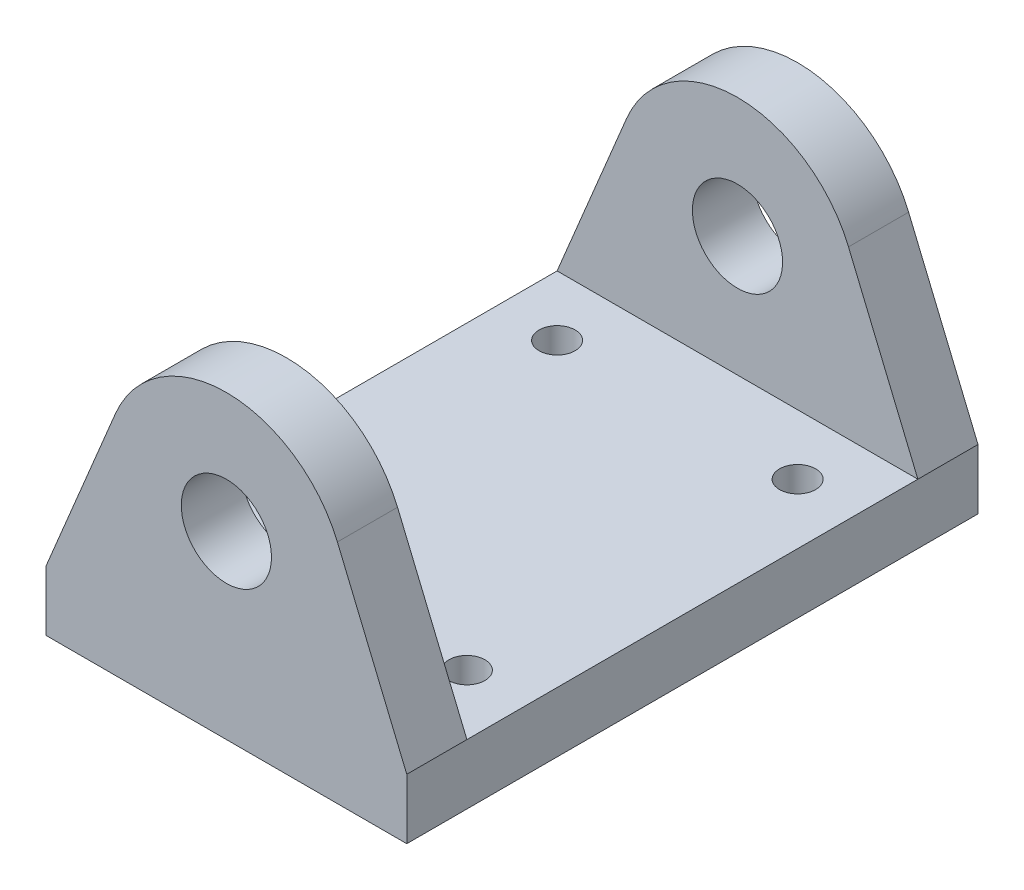
ISO-10303-21;
HEADER;
FILE_DESCRIPTION(('STEP AP214'),'2;1');
FILE_NAME('part.step','',(''),(''),'','','');
FILE_SCHEMA(('AUTOMOTIVE_DESIGN { 1 0 10303 214 1 1 1 1 }'));
ENDSEC;
DATA;
#1=APPLICATION_CONTEXT('core data for automotive mechanical design processes');
#2=APPLICATION_PROTOCOL_DEFINITION('international standard','automotive_design',2000,#1);
#3=PRODUCT_CONTEXT('',#1,'mechanical');
#4=PRODUCT('Part','Part','',(#3));
#5=PRODUCT_RELATED_PRODUCT_CATEGORY('part','',(#4));
#6=PRODUCT_DEFINITION_FORMATION('','',#4);
#7=PRODUCT_DEFINITION_CONTEXT('part definition',#1,'design');
#8=PRODUCT_DEFINITION('design','',#6,#7);
#9=PRODUCT_DEFINITION_SHAPE('','',#8);
#10=(LENGTH_UNIT() NAMED_UNIT(*) SI_UNIT(.MILLI.,.METRE.));
#11=(NAMED_UNIT(*) PLANE_ANGLE_UNIT() SI_UNIT($,.RADIAN.));
#12=(NAMED_UNIT(*) SI_UNIT($,.STERADIAN.) SOLID_ANGLE_UNIT());
#13=UNCERTAINTY_MEASURE_WITH_UNIT(LENGTH_MEASURE(1.E-05),#10,'distance_accuracy_value','');
#14=(GEOMETRIC_REPRESENTATION_CONTEXT(3) GLOBAL_UNCERTAINTY_ASSIGNED_CONTEXT((#13)) GLOBAL_UNIT_ASSIGNED_CONTEXT((#10,
#11,#12)) REPRESENTATION_CONTEXT('',''));
#15=CARTESIAN_POINT('',(0.,0.,0.));
#16=DIRECTION('',(0.,0.,1.));
#17=DIRECTION('',(1.,0.,0.));
#18=AXIS2_PLACEMENT_3D('',#15,#16,#17);
#19=CARTESIAN_POINT('',(-15.,-10.,23.75));
#20=DIRECTION('',(0.923076923076923,-0.384615384615384,0.));
#21=DIRECTION('',(0.384615384615384,0.923076923076923,0.));
#22=AXIS2_PLACEMENT_3D('',#19,#20,#21);
#23=PLANE('',#22);
#24=DIRECTION('',(0.,0.,-1.));
#25=VECTOR('',#24,1.);
#26=CARTESIAN_POINT('',(-9.23076923076924,3.84615384615385,23.75));
#27=LINE('',#26,#25);
#28=CARTESIAN_POINT('',(-9.23076923076924,3.84615384615385,23.75));
#29=VERTEX_POINT('',#28);
#30=CARTESIAN_POINT('',(-9.23076923076924,3.84615384615385,18.75));
#31=VERTEX_POINT('',#30);
#32=EDGE_CURVE('E149',#29,#31,#27,.T.);
#33=ORIENTED_EDGE('',*,*,#32,.T.);
#34=DIRECTION('',(-0.384615384615384,-0.923076923076923,0.));
#35=VECTOR('',#34,1.);
#36=CARTESIAN_POINT('',(-15.,-10.,18.75));
#37=LINE('',#36,#35);
#38=CARTESIAN_POINT('',(-15.,-10.,18.75));
#39=VERTEX_POINT('',#38);
#40=EDGE_CURVE('E129',#31,#39,#37,.T.);
#41=ORIENTED_EDGE('',*,*,#40,.T.);
#42=DIRECTION('',(0.,0.,-1.));
#43=VECTOR('',#42,1.);
#44=CARTESIAN_POINT('',(-15.,-10.,23.75));
#45=LINE('',#44,#43);
#46=CARTESIAN_POINT('',(-15.,-10.,23.75));
#47=VERTEX_POINT('',#46);
#48=EDGE_CURVE('E11',#47,#39,#45,.T.);
#49=ORIENTED_EDGE('',*,*,#48,.F.);
#50=DIRECTION('',(-0.384615384615384,-0.923076923076923,0.));
#51=VECTOR('',#50,1.);
#52=CARTESIAN_POINT('',(-15.,-10.,23.75));
#53=LINE('',#52,#51);
#54=EDGE_CURVE('E89',#29,#47,#53,.T.);
#55=ORIENTED_EDGE('',*,*,#54,.F.);
#56=EDGE_LOOP('',(#33,#41,#49,#55));
#57=FACE_BOUND('',#56,.T.);
#58=ADVANCED_FACE('F38',(#57),#23,.F.);
#59=CARTESIAN_POINT('',(15.,-10.,23.75));
#60=DIRECTION('',(-0.923076923076923,-0.384615384615384,0.));
#61=DIRECTION('',(0.384615384615384,-0.923076923076923,0.));
#62=AXIS2_PLACEMENT_3D('',#59,#60,#61);
#63=PLANE('',#62);
#64=DIRECTION('',(0.,0.,-1.));
#65=VECTOR('',#64,1.);
#66=CARTESIAN_POINT('',(15.,-10.,23.75));
#67=LINE('',#66,#65);
#68=CARTESIAN_POINT('',(15.,-10.,23.75));
#69=VERTEX_POINT('',#68);
#70=CARTESIAN_POINT('',(15.,-10.,18.75));
#71=VERTEX_POINT('',#70);
#72=EDGE_CURVE('E213',#69,#71,#67,.T.);
#73=ORIENTED_EDGE('',*,*,#72,.T.);
#74=DIRECTION('',(-0.384615384615384,0.923076923076923,0.));
#75=VECTOR('',#74,1.);
#76=CARTESIAN_POINT('',(15.,-10.,18.75));
#77=LINE('',#76,#75);
#78=CARTESIAN_POINT('',(9.23076923076923,3.84615384615385,18.75));
#79=VERTEX_POINT('',#78);
#80=EDGE_CURVE('E132',#71,#79,#77,.T.);
#81=ORIENTED_EDGE('',*,*,#80,.T.);
#82=DIRECTION('',(0.,0.,-1.));
#83=VECTOR('',#82,1.);
#84=CARTESIAN_POINT('',(9.23076923076923,3.84615384615385,23.75));
#85=LINE('',#84,#83);
#86=CARTESIAN_POINT('',(9.23076923076923,3.84615384615385,23.75));
#87=VERTEX_POINT('',#86);
#88=EDGE_CURVE('E208',#87,#79,#85,.T.);
#89=ORIENTED_EDGE('',*,*,#88,.F.);
#90=DIRECTION('',(-0.384615384615384,0.923076923076923,0.));
#91=VECTOR('',#90,1.);
#92=CARTESIAN_POINT('',(15.,-10.,23.75));
#93=LINE('',#92,#91);
#94=EDGE_CURVE('E191',#69,#87,#93,.T.);
#95=ORIENTED_EDGE('',*,*,#94,.F.);
#96=EDGE_LOOP('',(#73,#81,#89,#95));
#97=FACE_BOUND('',#96,.T.);
#98=ADVANCED_FACE('F274',(#97),#63,.F.);
#99=CARTESIAN_POINT('',(0.,0.,23.75));
#100=DIRECTION('',(0.,0.,-1.));
#101=DIRECTION('',(-1.,0.,0.));
#102=AXIS2_PLACEMENT_3D('',#99,#100,#101);
#103=CYLINDRICAL_SURFACE('',#102,10.);
#104=ORIENTED_EDGE('',*,*,#88,.T.);
#105=CARTESIAN_POINT('',(0.,0.,18.75));
#106=DIRECTION('',(0.,0.,1.));
#107=DIRECTION('',(0.,-1.,0.));
#108=AXIS2_PLACEMENT_3D('',#105,#106,#107);
#109=CIRCLE('',#108,10.);
#110=EDGE_CURVE('E239',#79,#31,#109,.T.);
#111=ORIENTED_EDGE('',*,*,#110,.T.);
#112=ORIENTED_EDGE('',*,*,#32,.F.);
#113=CARTESIAN_POINT('',(0.,0.,23.75));
#114=DIRECTION('',(0.,0.,1.));
#115=DIRECTION('',(1.,0.,0.));
#116=AXIS2_PLACEMENT_3D('',#113,#114,#115);
#117=CIRCLE('',#116,10.);
#118=EDGE_CURVE('E65',#87,#29,#117,.T.);
#119=ORIENTED_EDGE('',*,*,#118,.F.);
#120=EDGE_LOOP('',(#104,#111,#112,#119));
#121=FACE_BOUND('',#120,.T.);
#122=ADVANCED_FACE('F267',(#121),#103,.T.);
#123=CARTESIAN_POINT('',(0.,0.,23.75));
#124=DIRECTION('',(0.,0.,-1.));
#125=DIRECTION('',(-1.,0.,0.));
#126=AXIS2_PLACEMENT_3D('',#123,#124,#125);
#127=CYLINDRICAL_SURFACE('',#126,3.75);
#128=CARTESIAN_POINT('',(0.,0.,18.75));
#129=DIRECTION('',(0.,0.,1.));
#130=DIRECTION('',(0.,-1.,0.));
#131=AXIS2_PLACEMENT_3D('',#128,#129,#130);
#132=CIRCLE('',#131,3.75);
#133=CARTESIAN_POINT('',(0.,-3.75,18.75));
#134=VERTEX_POINT('',#133);
#135=EDGE_CURVE('E42',#134,#134,#132,.T.);
#136=ORIENTED_EDGE('',*,*,#135,.F.);
#137=EDGE_LOOP('',(#136));
#138=FACE_BOUND('',#137,.T.);
#139=CARTESIAN_POINT('',(0.,0.,23.75));
#140=DIRECTION('',(0.,0.,1.));
#141=DIRECTION('',(1.,0.,0.));
#142=AXIS2_PLACEMENT_3D('',#139,#140,#141);
#143=CIRCLE('',#142,3.75);
#144=CARTESIAN_POINT('',(3.75,0.,23.75));
#145=VERTEX_POINT('',#144);
#146=EDGE_CURVE('E181',#145,#145,#143,.T.);
#147=ORIENTED_EDGE('',*,*,#146,.T.);
#148=EDGE_LOOP('',(#147));
#149=FACE_BOUND('',#148,.T.);
#150=ADVANCED_FACE('F262',(#138,#149),#127,.F.);
#151=CARTESIAN_POINT('',(0.,0.,23.75));
#152=DIRECTION('',(0.,0.,1.));
#153=DIRECTION('',(1.,0.,0.));
#154=AXIS2_PLACEMENT_3D('',#151,#152,#153);
#155=PLANE('',#154);
#156=ORIENTED_EDGE('',*,*,#54,.T.);
#157=DIRECTION('',(0.,1.,0.));
#158=VECTOR('',#157,1.);
#159=CARTESIAN_POINT('',(-15.,-15.,23.75));
#160=LINE('',#159,#158);
#161=CARTESIAN_POINT('',(-15.,-15.,23.75));
#162=VERTEX_POINT('',#161);
#163=EDGE_CURVE('E155',#162,#47,#160,.T.);
#164=ORIENTED_EDGE('',*,*,#163,.F.);
#165=DIRECTION('',(-1.,0.,0.));
#166=VECTOR('',#165,1.);
#167=CARTESIAN_POINT('',(15.,-15.,23.75));
#168=LINE('',#167,#166);
#169=CARTESIAN_POINT('',(15.,-15.,23.75));
#170=VERTEX_POINT('',#169);
#171=EDGE_CURVE('E161',#170,#162,#168,.T.);
#172=ORIENTED_EDGE('',*,*,#171,.F.);
#173=DIRECTION('',(0.,1.,0.));
#174=VECTOR('',#173,1.);
#175=CARTESIAN_POINT('',(15.,-15.,23.75));
#176=LINE('',#175,#174);
#177=EDGE_CURVE('E160',#170,#69,#176,.T.);
#178=ORIENTED_EDGE('',*,*,#177,.T.);
#179=ORIENTED_EDGE('',*,*,#94,.T.);
#180=ORIENTED_EDGE('',*,*,#118,.T.);
#181=EDGE_LOOP('',(#156,#164,#172,#178,#179,#180));
#182=FACE_BOUND('',#181,.T.);
#183=ORIENTED_EDGE('',*,*,#146,.F.);
#184=EDGE_LOOP('',(#183));
#185=FACE_BOUND('',#184,.T.);
#186=ADVANCED_FACE('F258',(#182,#185),#155,.T.);
#187=CARTESIAN_POINT('',(0.,0.,-23.75));
#188=DIRECTION('',(0.,0.,1.));
#189=DIRECTION('',(1.,0.,0.));
#190=AXIS2_PLACEMENT_3D('',#187,#188,#189);
#191=PLANE('',#190);
#192=DIRECTION('',(-0.384615384615384,-0.923076923076923,0.));
#193=VECTOR('',#192,1.);
#194=CARTESIAN_POINT('',(-15.,-10.,-23.75));
#195=LINE('',#194,#193);
#196=CARTESIAN_POINT('',(-9.23076923076924,3.84615384615385,-23.75));
#197=VERTEX_POINT('',#196);
#198=CARTESIAN_POINT('',(-15.,-10.,-23.75));
#199=VERTEX_POINT('',#198);
#200=EDGE_CURVE('E185',#197,#199,#195,.T.);
#201=ORIENTED_EDGE('',*,*,#200,.F.);
#202=CARTESIAN_POINT('',(0.,0.,-23.75));
#203=DIRECTION('',(0.,0.,1.));
#204=DIRECTION('',(1.,0.,0.));
#205=AXIS2_PLACEMENT_3D('',#202,#203,#204);
#206=CIRCLE('',#205,10.);
#207=CARTESIAN_POINT('',(9.23076923076923,3.84615384615385,-23.75));
#208=VERTEX_POINT('',#207);
#209=EDGE_CURVE('E192',#208,#197,#206,.T.);
#210=ORIENTED_EDGE('',*,*,#209,.F.);
#211=DIRECTION('',(-0.384615384615384,0.923076923076923,0.));
#212=VECTOR('',#211,1.);
#213=CARTESIAN_POINT('',(15.,-10.,-23.75));
#214=LINE('',#213,#212);
#215=CARTESIAN_POINT('',(15.,-10.,-23.75));
#216=VERTEX_POINT('',#215);
#217=EDGE_CURVE('E199',#216,#208,#214,.T.);
#218=ORIENTED_EDGE('',*,*,#217,.F.);
#219=DIRECTION('',(0.,1.,0.));
#220=VECTOR('',#219,1.);
#221=CARTESIAN_POINT('',(15.,-15.,-23.75));
#222=LINE('',#221,#220);
#223=CARTESIAN_POINT('',(15.,-15.,-23.75));
#224=VERTEX_POINT('',#223);
#225=EDGE_CURVE('E167',#224,#216,#222,.T.);
#226=ORIENTED_EDGE('',*,*,#225,.F.);
#227=DIRECTION('',(1.,0.,0.));
#228=VECTOR('',#227,1.);
#229=CARTESIAN_POINT('',(-15.,-15.,-23.75));
#230=LINE('',#229,#228);
#231=CARTESIAN_POINT('',(-15.,-15.,-23.75));
#232=VERTEX_POINT('',#231);
#233=EDGE_CURVE('E246',#232,#224,#230,.T.);
#234=ORIENTED_EDGE('',*,*,#233,.F.);
#235=DIRECTION('',(0.,1.,0.));
#236=VECTOR('',#235,1.);
#237=CARTESIAN_POINT('',(-15.,-15.,-23.75));
#238=LINE('',#237,#236);
#239=EDGE_CURVE('E176',#232,#199,#238,.T.);
#240=ORIENTED_EDGE('',*,*,#239,.T.);
#241=EDGE_LOOP('',(#201,#210,#218,#226,#234,#240));
#242=FACE_BOUND('',#241,.T.);
#243=CARTESIAN_POINT('',(0.,0.,-23.75));
#244=DIRECTION('',(0.,0.,1.));
#245=DIRECTION('',(1.,0.,0.));
#246=AXIS2_PLACEMENT_3D('',#243,#244,#245);
#247=CIRCLE('',#246,3.75);
#248=CARTESIAN_POINT('',(3.75,0.,-23.75));
#249=VERTEX_POINT('',#248);
#250=EDGE_CURVE('E180',#249,#249,#247,.T.);
#251=ORIENTED_EDGE('',*,*,#250,.T.);
#252=EDGE_LOOP('',(#251));
#253=FACE_BOUND('',#252,.T.);
#254=ADVANCED_FACE('F261',(#242,#253),#191,.F.);
#255=CARTESIAN_POINT('',(-15.,-10.,-18.75));
#256=VERTEX_POINT('',#255);
#257=EDGE_CURVE('E48',#256,#199,#45,.T.);
#258=ORIENTED_EDGE('',*,*,#257,.F.);
#259=DIRECTION('',(0.384615384615384,0.923076923076923,0.));
#260=VECTOR('',#259,1.);
#261=CARTESIAN_POINT('',(-15.,-9.99999999999999,-18.75));
#262=LINE('',#261,#260);
#263=CARTESIAN_POINT('',(-9.23076923076924,3.84615384615385,-18.75));
#264=VERTEX_POINT('',#263);
#265=EDGE_CURVE('E236',#256,#264,#262,.T.);
#266=ORIENTED_EDGE('',*,*,#265,.T.);
#267=EDGE_CURVE('E84',#264,#197,#27,.T.);
#268=ORIENTED_EDGE('',*,*,#267,.T.);
#269=ORIENTED_EDGE('',*,*,#200,.T.);
#270=EDGE_LOOP('',(#258,#266,#268,#269));
#271=FACE_BOUND('',#270,.T.);
#272=ADVANCED_FACE('F40',(#271),#23,.F.);
#273=CARTESIAN_POINT('',(9.23076923076923,3.84615384615385,-18.75));
#274=VERTEX_POINT('',#273);
#275=EDGE_CURVE('E207',#274,#208,#85,.T.);
#276=ORIENTED_EDGE('',*,*,#275,.F.);
#277=DIRECTION('',(0.384615384615384,-0.923076923076923,0.));
#278=VECTOR('',#277,1.);
#279=CARTESIAN_POINT('',(15.,-9.99999999999999,-18.75));
#280=LINE('',#279,#278);
#281=CARTESIAN_POINT('',(15.,-10.,-18.75));
#282=VERTEX_POINT('',#281);
#283=EDGE_CURVE('E226',#274,#282,#280,.T.);
#284=ORIENTED_EDGE('',*,*,#283,.T.);
#285=EDGE_CURVE('E212',#282,#216,#67,.T.);
#286=ORIENTED_EDGE('',*,*,#285,.T.);
#287=ORIENTED_EDGE('',*,*,#217,.T.);
#288=EDGE_LOOP('',(#276,#284,#286,#287));
#289=FACE_BOUND('',#288,.T.);
#290=ADVANCED_FACE('F287',(#289),#63,.F.);
#291=ORIENTED_EDGE('',*,*,#267,.F.);
#292=CARTESIAN_POINT('',(0.,0.,-18.75));
#293=DIRECTION('',(0.,0.,-1.));
#294=DIRECTION('',(0.,1.,0.));
#295=AXIS2_PLACEMENT_3D('',#292,#293,#294);
#296=CIRCLE('',#295,10.);
#297=EDGE_CURVE('E219',#264,#274,#296,.T.);
#298=ORIENTED_EDGE('',*,*,#297,.T.);
#299=ORIENTED_EDGE('',*,*,#275,.T.);
#300=ORIENTED_EDGE('',*,*,#209,.T.);
#301=EDGE_LOOP('',(#291,#298,#299,#300));
#302=FACE_BOUND('',#301,.T.);
#303=ADVANCED_FACE('F277',(#302),#103,.T.);
#304=CARTESIAN_POINT('',(0.,0.,-18.75));
#305=DIRECTION('',(0.,0.,-1.));
#306=DIRECTION('',(0.,1.,0.));
#307=AXIS2_PLACEMENT_3D('',#304,#305,#306);
#308=CIRCLE('',#307,3.75);
#309=CARTESIAN_POINT('',(0.,3.75,-18.75));
#310=VERTEX_POINT('',#309);
#311=EDGE_CURVE('E216',#310,#310,#308,.T.);
#312=ORIENTED_EDGE('',*,*,#311,.F.);
#313=EDGE_LOOP('',(#312));
#314=FACE_BOUND('',#313,.T.);
#315=ORIENTED_EDGE('',*,*,#250,.F.);
#316=EDGE_LOOP('',(#315));
#317=FACE_BOUND('',#316,.T.);
#318=ADVANCED_FACE('F270',(#314,#317),#127,.F.);
#319=CARTESIAN_POINT('',(-15.,-15.,23.75));
#320=DIRECTION('',(1.,0.,0.));
#321=DIRECTION('',(0.,0.,-1.));
#322=AXIS2_PLACEMENT_3D('',#319,#320,#321);
#323=PLANE('',#322);
#324=ORIENTED_EDGE('',*,*,#48,.T.);
#325=DIRECTION('',(0.,0.,-1.));
#326=VECTOR('',#325,1.);
#327=CARTESIAN_POINT('',(-15.,-10.,18.75));
#328=LINE('',#327,#326);
#329=EDGE_CURVE('E136',#39,#256,#328,.T.);
#330=ORIENTED_EDGE('',*,*,#329,.T.);
#331=ORIENTED_EDGE('',*,*,#257,.T.);
#332=ORIENTED_EDGE('',*,*,#239,.F.);
#333=DIRECTION('',(0.,0.,-1.));
#334=VECTOR('',#333,1.);
#335=CARTESIAN_POINT('',(-15.,-15.,23.75));
#336=LINE('',#335,#334);
#337=EDGE_CURVE('E151',#162,#232,#336,.T.);
#338=ORIENTED_EDGE('',*,*,#337,.F.);
#339=ORIENTED_EDGE('',*,*,#163,.T.);
#340=EDGE_LOOP('',(#324,#330,#331,#332,#338,#339));
#341=FACE_BOUND('',#340,.T.);
#342=ADVANCED_FACE('F153',(#341),#323,.F.);
#343=CARTESIAN_POINT('',(15.,-15.,-23.75));
#344=DIRECTION('',(-1.,0.,0.));
#345=DIRECTION('',(0.,0.,1.));
#346=AXIS2_PLACEMENT_3D('',#343,#344,#345);
#347=PLANE('',#346);
#348=ORIENTED_EDGE('',*,*,#72,.F.);
#349=ORIENTED_EDGE('',*,*,#177,.F.);
#350=DIRECTION('',(0.,0.,1.));
#351=VECTOR('',#350,1.);
#352=CARTESIAN_POINT('',(15.,-15.,-23.75));
#353=LINE('',#352,#351);
#354=EDGE_CURVE('E169',#224,#170,#353,.T.);
#355=ORIENTED_EDGE('',*,*,#354,.F.);
#356=ORIENTED_EDGE('',*,*,#225,.T.);
#357=ORIENTED_EDGE('',*,*,#285,.F.);
#358=DIRECTION('',(0.,0.,-1.));
#359=VECTOR('',#358,1.);
#360=CARTESIAN_POINT('',(15.,-10.,18.75));
#361=LINE('',#360,#359);
#362=EDGE_CURVE('E144',#71,#282,#361,.T.);
#363=ORIENTED_EDGE('',*,*,#362,.F.);
#364=EDGE_LOOP('',(#348,#349,#355,#356,#357,#363));
#365=FACE_BOUND('',#364,.T.);
#366=ADVANCED_FACE('F257',(#365),#347,.F.);
#367=CARTESIAN_POINT('',(0.,-15.,0.));
#368=DIRECTION('',(0.,-1.,0.));
#369=DIRECTION('',(0.,0.,-1.));
#370=AXIS2_PLACEMENT_3D('',#367,#368,#369);
#371=PLANE('',#370);
#372=CARTESIAN_POINT('',(10.,-15.,-13.75));
#373=DIRECTION('',(0.,1.,0.));
#374=DIRECTION('',(0.,0.,-1.));
#375=AXIS2_PLACEMENT_3D('',#372,#373,#374);
#376=CIRCLE('',#375,1.5);
#377=CARTESIAN_POINT('',(10.,-15.,-15.25));
#378=VERTEX_POINT('',#377);
#379=EDGE_CURVE('E354',#378,#378,#376,.T.);
#380=ORIENTED_EDGE('',*,*,#379,.T.);
#381=EDGE_LOOP('',(#380));
#382=FACE_BOUND('',#381,.T.);
#383=CARTESIAN_POINT('',(-9.99999999999999,-15.,13.75));
#384=DIRECTION('',(0.,1.,0.));
#385=DIRECTION('',(0.,0.,-1.));
#386=AXIS2_PLACEMENT_3D('',#383,#384,#385);
#387=CIRCLE('',#386,1.5);
#388=CARTESIAN_POINT('',(-9.99999999999999,-15.,12.25));
#389=VERTEX_POINT('',#388);
#390=EDGE_CURVE('E346',#389,#389,#387,.T.);
#391=ORIENTED_EDGE('',*,*,#390,.T.);
#392=EDGE_LOOP('',(#391));
#393=FACE_BOUND('',#392,.T.);
#394=CARTESIAN_POINT('',(10.,-15.,13.75));
#395=DIRECTION('',(0.,1.,0.));
#396=DIRECTION('',(0.,0.,1.));
#397=AXIS2_PLACEMENT_3D('',#394,#395,#396);
#398=CIRCLE('',#397,1.5);
#399=CARTESIAN_POINT('',(10.,-15.,15.25));
#400=VERTEX_POINT('',#399);
#401=EDGE_CURVE('E339',#400,#400,#398,.T.);
#402=ORIENTED_EDGE('',*,*,#401,.T.);
#403=EDGE_LOOP('',(#402));
#404=FACE_BOUND('',#403,.T.);
#405=CARTESIAN_POINT('',(-10.,-15.,-13.75));
#406=DIRECTION('',(0.,1.,0.));
#407=DIRECTION('',(0.,0.,1.));
#408=AXIS2_PLACEMENT_3D('',#405,#406,#407);
#409=CIRCLE('',#408,1.5);
#410=CARTESIAN_POINT('',(-10.,-15.,-12.25));
#411=VERTEX_POINT('',#410);
#412=EDGE_CURVE('E327',#411,#411,#409,.T.);
#413=ORIENTED_EDGE('',*,*,#412,.T.);
#414=EDGE_LOOP('',(#413));
#415=FACE_BOUND('',#414,.T.);
#416=ORIENTED_EDGE('',*,*,#337,.T.);
#417=ORIENTED_EDGE('',*,*,#233,.T.);
#418=ORIENTED_EDGE('',*,*,#354,.T.);
#419=ORIENTED_EDGE('',*,*,#171,.T.);
#420=EDGE_LOOP('',(#416,#417,#418,#419));
#421=FACE_BOUND('',#420,.T.);
#422=ADVANCED_FACE('F253',(#382,#393,#404,#415,#421),#371,.T.);
#423=CARTESIAN_POINT('',(-15.,-10.,18.75));
#424=DIRECTION('',(0.,0.,1.));
#425=DIRECTION('',(0.,-1.,0.));
#426=AXIS2_PLACEMENT_3D('',#423,#424,#425);
#427=PLANE('',#426);
#428=ORIENTED_EDGE('',*,*,#135,.T.);
#429=EDGE_LOOP('',(#428));
#430=FACE_BOUND('',#429,.T.);
#431=ORIENTED_EDGE('',*,*,#110,.F.);
#432=ORIENTED_EDGE('',*,*,#80,.F.);
#433=DIRECTION('',(1.,0.,0.));
#434=VECTOR('',#433,1.);
#435=CARTESIAN_POINT('',(-15.,-10.,18.75));
#436=LINE('',#435,#434);
#437=EDGE_CURVE('E56',#39,#71,#436,.T.);
#438=ORIENTED_EDGE('',*,*,#437,.F.);
#439=ORIENTED_EDGE('',*,*,#40,.F.);
#440=EDGE_LOOP('',(#431,#432,#438,#439));
#441=FACE_BOUND('',#440,.T.);
#442=ADVANCED_FACE('F127',(#430,#441),#427,.F.);
#443=CARTESIAN_POINT('',(-15.,-10.,-18.75));
#444=DIRECTION('',(0.,0.,-1.));
#445=DIRECTION('',(0.,1.,0.));
#446=AXIS2_PLACEMENT_3D('',#443,#444,#445);
#447=PLANE('',#446);
#448=ORIENTED_EDGE('',*,*,#311,.T.);
#449=EDGE_LOOP('',(#448));
#450=FACE_BOUND('',#449,.T.);
#451=DIRECTION('',(1.,0.,0.));
#452=VECTOR('',#451,1.);
#453=CARTESIAN_POINT('',(-15.,-10.,-18.75));
#454=LINE('',#453,#452);
#455=EDGE_CURVE('E135',#256,#282,#454,.T.);
#456=ORIENTED_EDGE('',*,*,#455,.T.);
#457=ORIENTED_EDGE('',*,*,#283,.F.);
#458=ORIENTED_EDGE('',*,*,#297,.F.);
#459=ORIENTED_EDGE('',*,*,#265,.F.);
#460=EDGE_LOOP('',(#456,#457,#458,#459));
#461=FACE_BOUND('',#460,.T.);
#462=ADVANCED_FACE('F380',(#450,#461),#447,.F.);
#463=CARTESIAN_POINT('',(-15.,-10.,18.75));
#464=DIRECTION('',(0.,-1.,0.));
#465=DIRECTION('',(0.,0.,-1.));
#466=AXIS2_PLACEMENT_3D('',#463,#464,#465);
#467=PLANE('',#466);
#468=CARTESIAN_POINT('',(10.,-10.,-13.75));
#469=DIRECTION('',(0.,1.,0.));
#470=DIRECTION('',(0.,0.,-1.));
#471=AXIS2_PLACEMENT_3D('',#468,#469,#470);
#472=CIRCLE('',#471,1.5);
#473=CARTESIAN_POINT('',(10.,-10.,-15.25));
#474=VERTEX_POINT('',#473);
#475=EDGE_CURVE('E350',#474,#474,#472,.T.);
#476=ORIENTED_EDGE('',*,*,#475,.F.);
#477=EDGE_LOOP('',(#476));
#478=FACE_BOUND('',#477,.T.);
#479=CARTESIAN_POINT('',(-9.99999999999999,-10.,13.75));
#480=DIRECTION('',(0.,1.,0.));
#481=DIRECTION('',(0.,0.,-1.));
#482=AXIS2_PLACEMENT_3D('',#479,#480,#481);
#483=CIRCLE('',#482,1.5);
#484=CARTESIAN_POINT('',(-9.99999999999999,-10.,12.25));
#485=VERTEX_POINT('',#484);
#486=EDGE_CURVE('E358',#485,#485,#483,.T.);
#487=ORIENTED_EDGE('',*,*,#486,.F.);
#488=EDGE_LOOP('',(#487));
#489=FACE_BOUND('',#488,.T.);
#490=CARTESIAN_POINT('',(10.,-10.,13.75));
#491=DIRECTION('',(0.,1.,0.));
#492=DIRECTION('',(0.,0.,1.));
#493=AXIS2_PLACEMENT_3D('',#490,#491,#492);
#494=CIRCLE('',#493,1.5);
#495=CARTESIAN_POINT('',(10.,-10.,15.25));
#496=VERTEX_POINT('',#495);
#497=EDGE_CURVE('E342',#496,#496,#494,.T.);
#498=ORIENTED_EDGE('',*,*,#497,.F.);
#499=EDGE_LOOP('',(#498));
#500=FACE_BOUND('',#499,.T.);
#501=CARTESIAN_POINT('',(-10.,-10.,-13.75));
#502=DIRECTION('',(0.,1.,0.));
#503=DIRECTION('',(0.,0.,1.));
#504=AXIS2_PLACEMENT_3D('',#501,#502,#503);
#505=CIRCLE('',#504,1.5);
#506=CARTESIAN_POINT('',(-10.,-10.,-12.25));
#507=VERTEX_POINT('',#506);
#508=EDGE_CURVE('E332',#507,#507,#505,.T.);
#509=ORIENTED_EDGE('',*,*,#508,.F.);
#510=EDGE_LOOP('',(#509));
#511=FACE_BOUND('',#510,.T.);
#512=ORIENTED_EDGE('',*,*,#362,.T.);
#513=ORIENTED_EDGE('',*,*,#455,.F.);
#514=ORIENTED_EDGE('',*,*,#329,.F.);
#515=ORIENTED_EDGE('',*,*,#437,.T.);
#516=EDGE_LOOP('',(#512,#513,#514,#515));
#517=FACE_BOUND('',#516,.T.);
#518=ADVANCED_FACE('F140',(#478,#489,#500,#511,#517),#467,.F.);
#519=CARTESIAN_POINT('',(-10.,-15.,-13.75));
#520=DIRECTION('',(0.,1.,0.));
#521=DIRECTION('',(0.,0.,1.));
#522=AXIS2_PLACEMENT_3D('',#519,#520,#521);
#523=CYLINDRICAL_SURFACE('',#522,1.5);
#524=ORIENTED_EDGE('',*,*,#412,.F.);
#525=EDGE_LOOP('',(#524));
#526=FACE_BOUND('',#525,.T.);
#527=ORIENTED_EDGE('',*,*,#508,.T.);
#528=EDGE_LOOP('',(#527));
#529=FACE_BOUND('',#528,.T.);
#530=ADVANCED_FACE('F379',(#526,#529),#523,.F.);
#531=CARTESIAN_POINT('',(10.,-15.,13.75));
#532=DIRECTION('',(0.,1.,0.));
#533=DIRECTION('',(0.,0.,1.));
#534=AXIS2_PLACEMENT_3D('',#531,#532,#533);
#535=CYLINDRICAL_SURFACE('',#534,1.5);
#536=ORIENTED_EDGE('',*,*,#401,.F.);
#537=EDGE_LOOP('',(#536));
#538=FACE_BOUND('',#537,.T.);
#539=ORIENTED_EDGE('',*,*,#497,.T.);
#540=EDGE_LOOP('',(#539));
#541=FACE_BOUND('',#540,.T.);
#542=ADVANCED_FACE('F373',(#538,#541),#535,.F.);
#543=CARTESIAN_POINT('',(-9.99999999999999,-15.,13.75));
#544=DIRECTION('',(0.,1.,0.));
#545=DIRECTION('',(0.,0.,1.));
#546=AXIS2_PLACEMENT_3D('',#543,#544,#545);
#547=CYLINDRICAL_SURFACE('',#546,1.5);
#548=ORIENTED_EDGE('',*,*,#390,.F.);
#549=EDGE_LOOP('',(#548));
#550=FACE_BOUND('',#549,.T.);
#551=ORIENTED_EDGE('',*,*,#486,.T.);
#552=EDGE_LOOP('',(#551));
#553=FACE_BOUND('',#552,.T.);
#554=ADVANCED_FACE('F369',(#550,#553),#547,.F.);
#555=CARTESIAN_POINT('',(10.,-15.,-13.75));
#556=DIRECTION('',(0.,1.,0.));
#557=DIRECTION('',(0.,0.,1.));
#558=AXIS2_PLACEMENT_3D('',#555,#556,#557);
#559=CYLINDRICAL_SURFACE('',#558,1.5);
#560=ORIENTED_EDGE('',*,*,#379,.F.);
#561=EDGE_LOOP('',(#560));
#562=FACE_BOUND('',#561,.T.);
#563=ORIENTED_EDGE('',*,*,#475,.T.);
#564=EDGE_LOOP('',(#563));
#565=FACE_BOUND('',#564,.T.);
#566=ADVANCED_FACE('F372',(#562,#565),#559,.F.);
#567=CLOSED_SHELL('',(#58,#98,#122,#150,#186,#254,#272,#290,#303,#318,#342,#366,#422,#442,#462,
#518,#530,#542,#554,#566));
#568=MANIFOLD_SOLID_BREP('B2',#567);
#569=ADVANCED_BREP_SHAPE_REPRESENTATION('',(#18,#568),#14);
#570=SHAPE_DEFINITION_REPRESENTATION(#9,#569);
ENDSEC;
END-ISO-10303-21;
